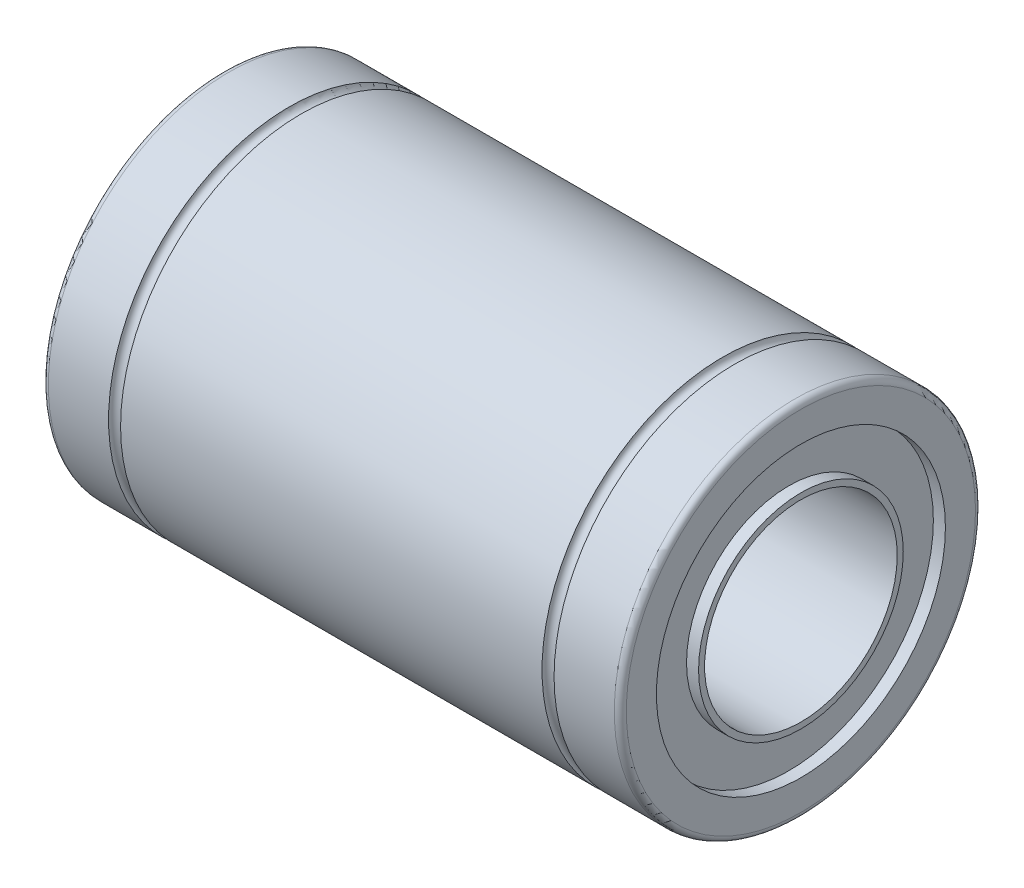
ISO-10303-21;
HEADER;
FILE_DESCRIPTION(('STEP AP214'),'2;1');
FILE_NAME('part.step','',(''),(''),'','','');
FILE_SCHEMA(('AUTOMOTIVE_DESIGN { 1 0 10303 214 1 1 1 1 }'));
ENDSEC;
DATA;
#1=APPLICATION_CONTEXT('core data for automotive mechanical design processes');
#2=APPLICATION_PROTOCOL_DEFINITION('international standard','automotive_design',2000,#1);
#3=PRODUCT_CONTEXT('',#1,'mechanical');
#4=PRODUCT('Part','Part','',(#3));
#5=PRODUCT_RELATED_PRODUCT_CATEGORY('part','',(#4));
#6=PRODUCT_DEFINITION_FORMATION('','',#4);
#7=PRODUCT_DEFINITION_CONTEXT('part definition',#1,'design');
#8=PRODUCT_DEFINITION('design','',#6,#7);
#9=PRODUCT_DEFINITION_SHAPE('','',#8);
#10=(LENGTH_UNIT() NAMED_UNIT(*) SI_UNIT(.MILLI.,.METRE.));
#11=(NAMED_UNIT(*) PLANE_ANGLE_UNIT() SI_UNIT($,.RADIAN.));
#12=(NAMED_UNIT(*) SI_UNIT($,.STERADIAN.) SOLID_ANGLE_UNIT());
#13=UNCERTAINTY_MEASURE_WITH_UNIT(LENGTH_MEASURE(1.E-05),#10,'distance_accuracy_value','');
#14=(GEOMETRIC_REPRESENTATION_CONTEXT(3) GLOBAL_UNCERTAINTY_ASSIGNED_CONTEXT((#13)) GLOBAL_UNIT_ASSIGNED_CONTEXT((#10,
#11,#12)) REPRESENTATION_CONTEXT('',''));
#15=CARTESIAN_POINT('',(0.,0.,0.));
#16=DIRECTION('',(0.,0.,1.));
#17=DIRECTION('',(1.,0.,0.));
#18=AXIS2_PLACEMENT_3D('',#15,#16,#17);
#19=CARTESIAN_POINT('',(-12.,0.,0.));
#20=DIRECTION('',(1.,0.,0.));
#21=DIRECTION('',(0.,0.,-1.));
#22=AXIS2_PLACEMENT_3D('',#19,#20,#21);
#23=CYLINDRICAL_SURFACE('',#22,7.5);
#24=CARTESIAN_POINT('',(-8.75,0.,0.));
#25=DIRECTION('',(-1.,0.,0.));
#26=DIRECTION('',(0.,0.,1.));
#27=AXIS2_PLACEMENT_3D('',#24,#25,#26);
#28=CIRCLE('',#27,7.5);
#29=CARTESIAN_POINT('',(-8.75,0.,7.5));
#30=VERTEX_POINT('',#29);
#31=EDGE_CURVE('E51',#30,#30,#28,.T.);
#32=ORIENTED_EDGE('',*,*,#31,.F.);
#33=EDGE_LOOP('',(#32));
#34=FACE_BOUND('',#33,.T.);
#35=CARTESIAN_POINT('',(8.75,0.,0.));
#36=DIRECTION('',(1.,0.,0.));
#37=DIRECTION('',(0.,0.,-1.));
#38=AXIS2_PLACEMENT_3D('',#35,#36,#37);
#39=CIRCLE('',#38,7.5);
#40=CARTESIAN_POINT('',(8.75,0.,-7.5));
#41=VERTEX_POINT('',#40);
#42=EDGE_CURVE('E35',#41,#41,#39,.F.);
#43=ORIENTED_EDGE('',*,*,#42,.T.);
#44=EDGE_LOOP('',(#43));
#45=FACE_BOUND('',#44,.T.);
#46=ADVANCED_FACE('F31',(#34,#45),#23,.T.);
#47=CARTESIAN_POINT('',(11.75,0.,0.));
#48=DIRECTION('',(1.,0.,0.));
#49=DIRECTION('',(0.,0.,-1.));
#50=AXIS2_PLACEMENT_3D('',#47,#48,#49);
#51=CIRCLE('',#50,7.5);
#52=CARTESIAN_POINT('',(11.75,0.,-7.5));
#53=VERTEX_POINT('',#52);
#54=EDGE_CURVE('E44',#53,#53,#51,.F.);
#55=ORIENTED_EDGE('',*,*,#54,.T.);
#56=EDGE_LOOP('',(#55));
#57=FACE_BOUND('',#56,.T.);
#58=CARTESIAN_POINT('',(9.25,0.,0.));
#59=DIRECTION('',(-1.,0.,0.));
#60=DIRECTION('',(0.,0.,1.));
#61=AXIS2_PLACEMENT_3D('',#58,#59,#60);
#62=CIRCLE('',#61,7.5);
#63=CARTESIAN_POINT('',(9.25,0.,7.5));
#64=VERTEX_POINT('',#63);
#65=EDGE_CURVE('E54',#64,#64,#62,.F.);
#66=ORIENTED_EDGE('',*,*,#65,.T.);
#67=EDGE_LOOP('',(#66));
#68=FACE_BOUND('',#67,.T.);
#69=ADVANCED_FACE('F73',(#57,#68),#23,.T.);
#70=CARTESIAN_POINT('',(-12.,0.,0.));
#71=DIRECTION('',(1.,0.,0.));
#72=DIRECTION('',(0.,0.,-1.));
#73=AXIS2_PLACEMENT_3D('',#70,#71,#72);
#74=CYLINDRICAL_SURFACE('',#73,6.);
#75=CARTESIAN_POINT('',(-12.,0.,0.));
#76=DIRECTION('',(1.,0.,0.));
#77=DIRECTION('',(0.,0.,-1.));
#78=AXIS2_PLACEMENT_3D('',#75,#76,#77);
#79=CIRCLE('',#78,6.);
#80=CARTESIAN_POINT('',(-12.,0.,-6.));
#81=VERTEX_POINT('',#80);
#82=EDGE_CURVE('E123',#81,#81,#79,.T.);
#83=ORIENTED_EDGE('',*,*,#82,.F.);
#84=EDGE_LOOP('',(#83));
#85=FACE_BOUND('',#84,.T.);
#86=CARTESIAN_POINT('',(-11.5,0.,0.));
#87=DIRECTION('',(1.,0.,0.));
#88=DIRECTION('',(0.,0.,-1.));
#89=AXIS2_PLACEMENT_3D('',#86,#87,#88);
#90=CIRCLE('',#89,6.);
#91=CARTESIAN_POINT('',(-11.5,0.,-6.));
#92=VERTEX_POINT('',#91);
#93=EDGE_CURVE('E120',#92,#92,#90,.F.);
#94=ORIENTED_EDGE('',*,*,#93,.F.);
#95=EDGE_LOOP('',(#94));
#96=FACE_BOUND('',#95,.T.);
#97=ADVANCED_FACE('F80',(#85,#96),#74,.F.);
#98=CARTESIAN_POINT('',(11.5,0.,0.));
#99=DIRECTION('',(1.,0.,0.));
#100=DIRECTION('',(0.,0.,-1.));
#101=AXIS2_PLACEMENT_3D('',#98,#99,#100);
#102=CIRCLE('',#101,6.);
#103=CARTESIAN_POINT('',(11.5,0.,-6.));
#104=VERTEX_POINT('',#103);
#105=EDGE_CURVE('E131',#104,#104,#102,.T.);
#106=ORIENTED_EDGE('',*,*,#105,.F.);
#107=EDGE_LOOP('',(#106));
#108=FACE_BOUND('',#107,.T.);
#109=CARTESIAN_POINT('',(12.,0.,0.));
#110=DIRECTION('',(1.,0.,0.));
#111=DIRECTION('',(0.,0.,-1.));
#112=AXIS2_PLACEMENT_3D('',#109,#110,#111);
#113=CIRCLE('',#112,6.);
#114=CARTESIAN_POINT('',(12.,0.,-6.));
#115=VERTEX_POINT('',#114);
#116=EDGE_CURVE('E128',#115,#115,#113,.T.);
#117=ORIENTED_EDGE('',*,*,#116,.T.);
#118=EDGE_LOOP('',(#117));
#119=FACE_BOUND('',#118,.T.);
#120=ADVANCED_FACE('F87',(#108,#119),#74,.F.);
#121=CARTESIAN_POINT('',(-9.25,0.,0.));
#122=DIRECTION('',(1.,0.,0.));
#123=DIRECTION('',(0.,0.,-1.));
#124=AXIS2_PLACEMENT_3D('',#121,#122,#123);
#125=CIRCLE('',#124,7.5);
#126=CARTESIAN_POINT('',(-9.25,0.,-7.5));
#127=VERTEX_POINT('',#126);
#128=EDGE_CURVE('E48',#127,#127,#125,.T.);
#129=ORIENTED_EDGE('',*,*,#128,.F.);
#130=EDGE_LOOP('',(#129));
#131=FACE_BOUND('',#130,.T.);
#132=CARTESIAN_POINT('',(-11.75,0.,0.));
#133=DIRECTION('',(1.,0.,0.));
#134=DIRECTION('',(0.,0.,-1.));
#135=AXIS2_PLACEMENT_3D('',#132,#133,#134);
#136=CIRCLE('',#135,7.5);
#137=CARTESIAN_POINT('',(-11.75,0.,-7.5));
#138=VERTEX_POINT('',#137);
#139=EDGE_CURVE('E39',#138,#138,#136,.T.);
#140=ORIENTED_EDGE('',*,*,#139,.T.);
#141=EDGE_LOOP('',(#140));
#142=FACE_BOUND('',#141,.T.);
#143=ADVANCED_FACE('F76',(#131,#142),#23,.T.);
#144=CARTESIAN_POINT('',(-12.,0.,-16.6414213562373));
#145=DIRECTION('',(1.,0.,0.));
#146=DIRECTION('',(0.,0.,-1.));
#147=AXIS2_PLACEMENT_3D('',#144,#145,#146);
#148=PLANE('',#147);
#149=CARTESIAN_POINT('',(-12.,0.,0.));
#150=DIRECTION('',(1.,0.,0.));
#151=DIRECTION('',(0.,0.,-1.));
#152=AXIS2_PLACEMENT_3D('',#149,#150,#151);
#153=CIRCLE('',#152,7.25);
#154=CARTESIAN_POINT('',(-12.,0.,-7.25));
#155=VERTEX_POINT('',#154);
#156=EDGE_CURVE('E10',#155,#155,#153,.F.);
#157=ORIENTED_EDGE('',*,*,#156,.T.);
#158=EDGE_LOOP('',(#157));
#159=FACE_BOUND('',#158,.T.);
#160=ORIENTED_EDGE('',*,*,#82,.T.);
#161=EDGE_LOOP('',(#160));
#162=FACE_BOUND('',#161,.T.);
#163=ADVANCED_FACE('F86',(#159,#162),#148,.F.);
#164=CARTESIAN_POINT('',(12.,0.,-16.6414213562373));
#165=DIRECTION('',(1.,0.,0.));
#166=DIRECTION('',(0.,0.,-1.));
#167=AXIS2_PLACEMENT_3D('',#164,#165,#166);
#168=PLANE('',#167);
#169=CARTESIAN_POINT('',(12.,0.,0.));
#170=DIRECTION('',(1.,0.,0.));
#171=DIRECTION('',(0.,0.,-1.));
#172=AXIS2_PLACEMENT_3D('',#169,#170,#171);
#173=CIRCLE('',#172,7.25);
#174=CARTESIAN_POINT('',(12.,0.,-7.25));
#175=VERTEX_POINT('',#174);
#176=EDGE_CURVE('E118',#175,#175,#173,.T.);
#177=ORIENTED_EDGE('',*,*,#176,.T.);
#178=EDGE_LOOP('',(#177));
#179=FACE_BOUND('',#178,.T.);
#180=ORIENTED_EDGE('',*,*,#116,.F.);
#181=EDGE_LOOP('',(#180));
#182=FACE_BOUND('',#181,.T.);
#183=ADVANCED_FACE('F93',(#179,#182),#168,.T.);
#184=CARTESIAN_POINT('',(-11.5,0.,-16.6414213562373));
#185=DIRECTION('',(1.,0.,0.));
#186=DIRECTION('',(0.,0.,-1.));
#187=AXIS2_PLACEMENT_3D('',#184,#185,#186);
#188=PLANE('',#187);
#189=CARTESIAN_POINT('',(-11.5,0.,0.));
#190=DIRECTION('',(1.,0.,0.));
#191=DIRECTION('',(0.,0.,-1.));
#192=AXIS2_PLACEMENT_3D('',#189,#190,#191);
#193=CIRCLE('',#192,4.25);
#194=CARTESIAN_POINT('',(-11.5,0.,-4.25));
#195=VERTEX_POINT('',#194);
#196=EDGE_CURVE('E137',#195,#195,#193,.T.);
#197=ORIENTED_EDGE('',*,*,#196,.T.);
#198=EDGE_LOOP('',(#197));
#199=FACE_BOUND('',#198,.T.);
#200=ORIENTED_EDGE('',*,*,#93,.T.);
#201=EDGE_LOOP('',(#200));
#202=FACE_BOUND('',#201,.T.);
#203=ADVANCED_FACE('F175',(#199,#202),#188,.F.);
#204=CARTESIAN_POINT('',(11.5,0.,-16.6414213562373));
#205=DIRECTION('',(1.,0.,0.));
#206=DIRECTION('',(0.,0.,-1.));
#207=AXIS2_PLACEMENT_3D('',#204,#205,#206);
#208=PLANE('',#207);
#209=CARTESIAN_POINT('',(11.5,0.,0.));
#210=DIRECTION('',(1.,0.,0.));
#211=DIRECTION('',(0.,0.,-1.));
#212=AXIS2_PLACEMENT_3D('',#209,#210,#211);
#213=CIRCLE('',#212,4.25);
#214=CARTESIAN_POINT('',(11.5,0.,-4.25));
#215=VERTEX_POINT('',#214);
#216=EDGE_CURVE('E134',#215,#215,#213,.T.);
#217=ORIENTED_EDGE('',*,*,#216,.F.);
#218=EDGE_LOOP('',(#217));
#219=FACE_BOUND('',#218,.T.);
#220=ORIENTED_EDGE('',*,*,#105,.T.);
#221=EDGE_LOOP('',(#220));
#222=FACE_BOUND('',#221,.T.);
#223=ADVANCED_FACE('F170',(#219,#222),#208,.T.);
#224=CARTESIAN_POINT('',(-12.,0.,0.));
#225=DIRECTION('',(1.,0.,0.));
#226=DIRECTION('',(0.,0.,-1.));
#227=AXIS2_PLACEMENT_3D('',#224,#225,#226);
#228=CYLINDRICAL_SURFACE('',#227,4.25);
#229=CARTESIAN_POINT('',(-12.,0.,0.));
#230=DIRECTION('',(1.,0.,0.));
#231=DIRECTION('',(0.,0.,-1.));
#232=AXIS2_PLACEMENT_3D('',#229,#230,#231);
#233=CIRCLE('',#232,4.25);
#234=CARTESIAN_POINT('',(-12.,0.,-4.25));
#235=VERTEX_POINT('',#234);
#236=EDGE_CURVE('E140',#235,#235,#233,.T.);
#237=ORIENTED_EDGE('',*,*,#236,.T.);
#238=EDGE_LOOP('',(#237));
#239=FACE_BOUND('',#238,.T.);
#240=ORIENTED_EDGE('',*,*,#196,.F.);
#241=EDGE_LOOP('',(#240));
#242=FACE_BOUND('',#241,.T.);
#243=ADVANCED_FACE('F160',(#239,#242),#228,.T.);
#244=CARTESIAN_POINT('',(-12.,0.,0.));
#245=DIRECTION('',(1.,0.,0.));
#246=DIRECTION('',(0.,0.,-1.));
#247=AXIS2_PLACEMENT_3D('',#244,#245,#246);
#248=CYLINDRICAL_SURFACE('',#247,4.);
#249=CARTESIAN_POINT('',(-12.,0.,0.));
#250=DIRECTION('',(1.,0.,0.));
#251=DIRECTION('',(0.,0.,-1.));
#252=AXIS2_PLACEMENT_3D('',#249,#250,#251);
#253=CIRCLE('',#252,4.);
#254=CARTESIAN_POINT('',(-12.,0.,-4.));
#255=VERTEX_POINT('',#254);
#256=EDGE_CURVE('E143',#255,#255,#253,.T.);
#257=ORIENTED_EDGE('',*,*,#256,.F.);
#258=EDGE_LOOP('',(#257));
#259=FACE_BOUND('',#258,.T.);
#260=CARTESIAN_POINT('',(12.,0.,0.));
#261=DIRECTION('',(1.,0.,0.));
#262=DIRECTION('',(0.,0.,-1.));
#263=AXIS2_PLACEMENT_3D('',#260,#261,#262);
#264=CIRCLE('',#263,4.);
#265=CARTESIAN_POINT('',(12.,0.,-4.));
#266=VERTEX_POINT('',#265);
#267=EDGE_CURVE('E53',#266,#266,#264,.T.);
#268=ORIENTED_EDGE('',*,*,#267,.T.);
#269=EDGE_LOOP('',(#268));
#270=FACE_BOUND('',#269,.T.);
#271=ADVANCED_FACE('F152',(#259,#270),#248,.F.);
#272=ORIENTED_EDGE('',*,*,#216,.T.);
#273=EDGE_LOOP('',(#272));
#274=FACE_BOUND('',#273,.T.);
#275=CARTESIAN_POINT('',(12.,0.,0.));
#276=DIRECTION('',(1.,0.,0.));
#277=DIRECTION('',(0.,0.,-1.));
#278=AXIS2_PLACEMENT_3D('',#275,#276,#277);
#279=CIRCLE('',#278,4.25);
#280=CARTESIAN_POINT('',(12.,0.,-4.25));
#281=VERTEX_POINT('',#280);
#282=EDGE_CURVE('E146',#281,#281,#279,.T.);
#283=ORIENTED_EDGE('',*,*,#282,.F.);
#284=EDGE_LOOP('',(#283));
#285=FACE_BOUND('',#284,.T.);
#286=ADVANCED_FACE('F156',(#274,#285),#228,.T.);
#287=CARTESIAN_POINT('',(-12.,0.,-16.6414213562373));
#288=DIRECTION('',(1.,0.,0.));
#289=DIRECTION('',(0.,0.,-1.));
#290=AXIS2_PLACEMENT_3D('',#287,#288,#289);
#291=PLANE('',#290);
#292=ORIENTED_EDGE('',*,*,#256,.T.);
#293=EDGE_LOOP('',(#292));
#294=FACE_BOUND('',#293,.T.);
#295=ORIENTED_EDGE('',*,*,#236,.F.);
#296=EDGE_LOOP('',(#295));
#297=FACE_BOUND('',#296,.T.);
#298=ADVANCED_FACE('F110',(#294,#297),#291,.F.);
#299=CARTESIAN_POINT('',(12.,0.,-16.6414213562373));
#300=DIRECTION('',(1.,0.,0.));
#301=DIRECTION('',(0.,0.,-1.));
#302=AXIS2_PLACEMENT_3D('',#299,#300,#301);
#303=PLANE('',#302);
#304=ORIENTED_EDGE('',*,*,#267,.F.);
#305=EDGE_LOOP('',(#304));
#306=FACE_BOUND('',#305,.T.);
#307=ORIENTED_EDGE('',*,*,#282,.T.);
#308=EDGE_LOOP('',(#307));
#309=FACE_BOUND('',#308,.T.);
#310=ADVANCED_FACE('F105',(#306,#309),#303,.T.);
#311=CARTESIAN_POINT('',(11.75,0.,0.));
#312=DIRECTION('',(1.,0.,0.));
#313=DIRECTION('',(0.,0.,-1.));
#314=AXIS2_PLACEMENT_3D('',#311,#312,#313);
#315=TOROIDAL_SURFACE('',#314,7.25,0.25);
#316=ORIENTED_EDGE('',*,*,#54,.F.);
#317=EDGE_LOOP('',(#316));
#318=FACE_BOUND('',#317,.T.);
#319=ORIENTED_EDGE('',*,*,#176,.F.);
#320=EDGE_LOOP('',(#319));
#321=FACE_BOUND('',#320,.T.);
#322=ADVANCED_FACE('F100',(#318,#321),#315,.T.);
#323=CARTESIAN_POINT('',(-11.75,0.,0.));
#324=DIRECTION('',(1.,0.,0.));
#325=DIRECTION('',(0.,0.,-1.));
#326=AXIS2_PLACEMENT_3D('',#323,#324,#325);
#327=TOROIDAL_SURFACE('',#326,7.25,0.25);
#328=ORIENTED_EDGE('',*,*,#156,.F.);
#329=EDGE_LOOP('',(#328));
#330=FACE_BOUND('',#329,.T.);
#331=ORIENTED_EDGE('',*,*,#139,.F.);
#332=EDGE_LOOP('',(#331));
#333=FACE_BOUND('',#332,.T.);
#334=ADVANCED_FACE('F33',(#330,#333),#327,.T.);
#335=CARTESIAN_POINT('',(-9.,0.,0.));
#336=DIRECTION('',(1.,0.,0.));
#337=DIRECTION('',(0.,0.,-1.));
#338=AXIS2_PLACEMENT_3D('',#335,#336,#337);
#339=TOROIDAL_SURFACE('',#338,7.5,0.25);
#340=ORIENTED_EDGE('',*,*,#31,.T.);
#341=EDGE_LOOP('',(#340));
#342=FACE_BOUND('',#341,.T.);
#343=ORIENTED_EDGE('',*,*,#128,.T.);
#344=EDGE_LOOP('',(#343));
#345=FACE_BOUND('',#344,.T.);
#346=ADVANCED_FACE('F65',(#342,#345),#339,.F.);
#347=CARTESIAN_POINT('',(9.,0.,0.));
#348=DIRECTION('',(-1.,0.,0.));
#349=DIRECTION('',(0.,0.,1.));
#350=AXIS2_PLACEMENT_3D('',#347,#348,#349);
#351=TOROIDAL_SURFACE('',#350,7.5,0.25);
#352=ORIENTED_EDGE('',*,*,#42,.F.);
#353=EDGE_LOOP('',(#352));
#354=FACE_BOUND('',#353,.T.);
#355=ORIENTED_EDGE('',*,*,#65,.F.);
#356=EDGE_LOOP('',(#355));
#357=FACE_BOUND('',#356,.T.);
#358=ADVANCED_FACE('F62',(#354,#357),#351,.F.);
#359=CLOSED_SHELL('',(#46,#69,#97,#120,#143,#163,#183,#203,#223,#243,#271,#286,#298,#310,#322,
#334,#346,#358));
#360=MANIFOLD_SOLID_BREP('B2',#359);
#361=ADVANCED_BREP_SHAPE_REPRESENTATION('',(#18,#360),#14);
#362=SHAPE_DEFINITION_REPRESENTATION(#9,#361);
ENDSEC;
END-ISO-10303-21;
